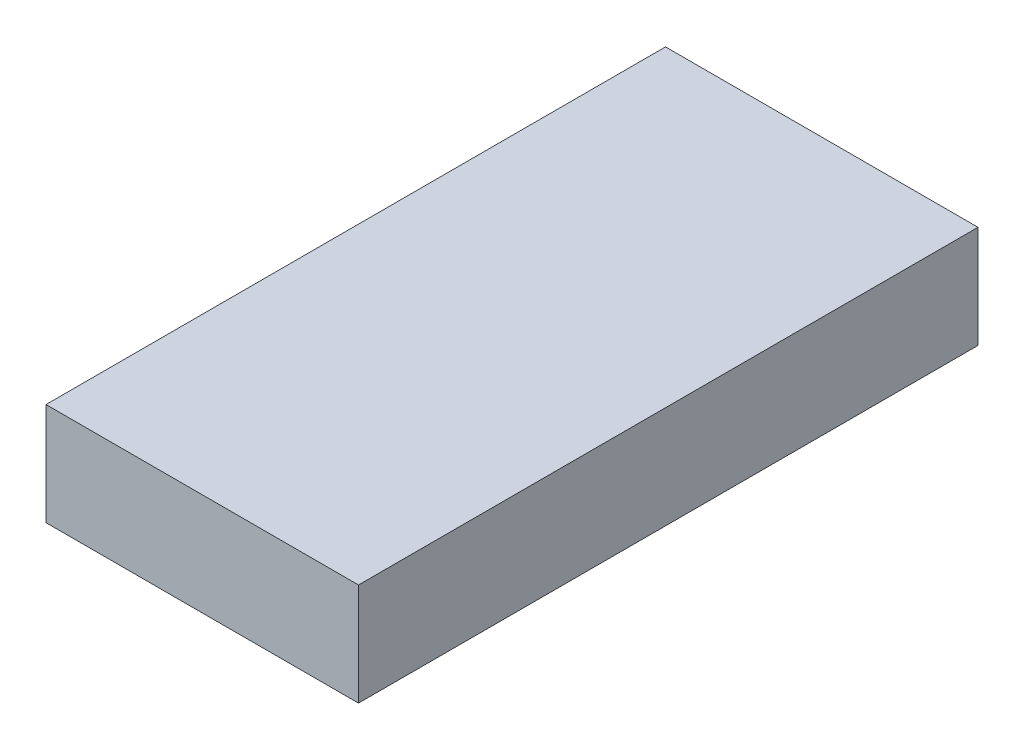
ISO-10303-21;
HEADER;
FILE_DESCRIPTION(('STEP AP214'),'2;1');
FILE_NAME('part.step','',(''),(''),'','','');
FILE_SCHEMA(('AUTOMOTIVE_DESIGN { 1 0 10303 214 1 1 1 1 }'));
ENDSEC;
DATA;
#1=APPLICATION_CONTEXT('core data for automotive mechanical design processes');
#2=APPLICATION_PROTOCOL_DEFINITION('international standard','automotive_design',2000,#1);
#3=PRODUCT_CONTEXT('',#1,'mechanical');
#4=PRODUCT('Part','Part','',(#3));
#5=PRODUCT_RELATED_PRODUCT_CATEGORY('part','',(#4));
#6=PRODUCT_DEFINITION_FORMATION('','',#4);
#7=PRODUCT_DEFINITION_CONTEXT('part definition',#1,'design');
#8=PRODUCT_DEFINITION('design','',#6,#7);
#9=PRODUCT_DEFINITION_SHAPE('','',#8);
#10=(LENGTH_UNIT() NAMED_UNIT(*) SI_UNIT(.MILLI.,.METRE.));
#11=(NAMED_UNIT(*) PLANE_ANGLE_UNIT() SI_UNIT($,.RADIAN.));
#12=(NAMED_UNIT(*) SI_UNIT($,.STERADIAN.) SOLID_ANGLE_UNIT());
#13=UNCERTAINTY_MEASURE_WITH_UNIT(LENGTH_MEASURE(1.E-05),#10,'distance_accuracy_value','');
#14=(GEOMETRIC_REPRESENTATION_CONTEXT(3) GLOBAL_UNCERTAINTY_ASSIGNED_CONTEXT((#13)) GLOBAL_UNIT_ASSIGNED_CONTEXT((#10,
#11,#12)) REPRESENTATION_CONTEXT('',''));
#15=CARTESIAN_POINT('',(0.,0.,0.));
#16=DIRECTION('',(0.,0.,1.));
#17=DIRECTION('',(1.,0.,0.));
#18=AXIS2_PLACEMENT_3D('',#15,#16,#17);
#19=CARTESIAN_POINT('',(17.1,11.2,33.9));
#20=DIRECTION('',(-1.,0.,0.));
#21=DIRECTION('',(0.,0.,1.));
#22=AXIS2_PLACEMENT_3D('',#19,#20,#21);
#23=PLANE('',#22);
#24=DIRECTION('',(0.,0.,-1.));
#25=VECTOR('',#24,1.);
#26=CARTESIAN_POINT('',(17.1,0.,33.9));
#27=LINE('',#26,#25);
#28=CARTESIAN_POINT('',(17.1,0.,33.9));
#29=VERTEX_POINT('',#28);
#30=CARTESIAN_POINT('',(17.1,0.,-33.9));
#31=VERTEX_POINT('',#30);
#32=EDGE_CURVE('E98',#29,#31,#27,.T.);
#33=ORIENTED_EDGE('',*,*,#32,.T.);
#34=DIRECTION('',(0.,-1.,0.));
#35=VECTOR('',#34,1.);
#36=CARTESIAN_POINT('',(17.1,11.2,-33.9));
#37=LINE('',#36,#35);
#38=CARTESIAN_POINT('',(17.1,11.2,-33.9));
#39=VERTEX_POINT('',#38);
#40=EDGE_CURVE('E11',#39,#31,#37,.T.);
#41=ORIENTED_EDGE('',*,*,#40,.F.);
#42=DIRECTION('',(0.,0.,-1.));
#43=VECTOR('',#42,1.);
#44=CARTESIAN_POINT('',(17.1,11.2,33.9));
#45=LINE('',#44,#43);
#46=CARTESIAN_POINT('',(17.1,11.2,33.9));
#47=VERTEX_POINT('',#46);
#48=EDGE_CURVE('E86',#47,#39,#45,.T.);
#49=ORIENTED_EDGE('',*,*,#48,.F.);
#50=DIRECTION('',(0.,-1.,0.));
#51=VECTOR('',#50,1.);
#52=CARTESIAN_POINT('',(17.1,11.2,33.9));
#53=LINE('',#52,#51);
#54=EDGE_CURVE('E94',#47,#29,#53,.T.);
#55=ORIENTED_EDGE('',*,*,#54,.T.);
#56=EDGE_LOOP('',(#33,#41,#49,#55));
#57=FACE_BOUND('',#56,.T.);
#58=ADVANCED_FACE('F35',(#57),#23,.F.);
#59=CARTESIAN_POINT('',(-17.1,11.2,-33.9));
#60=DIRECTION('',(0.,0.,1.));
#61=DIRECTION('',(1.,0.,0.));
#62=AXIS2_PLACEMENT_3D('',#59,#60,#61);
#63=PLANE('',#62);
#64=DIRECTION('',(-1.,0.,0.));
#65=VECTOR('',#64,1.);
#66=CARTESIAN_POINT('',(-17.1,0.,-33.9));
#67=LINE('',#66,#65);
#68=CARTESIAN_POINT('',(-17.1,0.,-33.9));
#69=VERTEX_POINT('',#68);
#70=EDGE_CURVE('E90',#31,#69,#67,.T.);
#71=ORIENTED_EDGE('',*,*,#70,.T.);
#72=DIRECTION('',(0.,-1.,0.));
#73=VECTOR('',#72,1.);
#74=CARTESIAN_POINT('',(-17.1,11.2,-33.9));
#75=LINE('',#74,#73);
#76=CARTESIAN_POINT('',(-17.1,11.2,-33.9));
#77=VERTEX_POINT('',#76);
#78=EDGE_CURVE('E43',#77,#69,#75,.T.);
#79=ORIENTED_EDGE('',*,*,#78,.F.);
#80=DIRECTION('',(-1.,0.,0.));
#81=VECTOR('',#80,1.);
#82=CARTESIAN_POINT('',(-17.1,11.2,-33.9));
#83=LINE('',#82,#81);
#84=EDGE_CURVE('E81',#39,#77,#83,.T.);
#85=ORIENTED_EDGE('',*,*,#84,.F.);
#86=ORIENTED_EDGE('',*,*,#40,.T.);
#87=EDGE_LOOP('',(#71,#79,#85,#86));
#88=FACE_BOUND('',#87,.T.);
#89=ADVANCED_FACE('F89',(#88),#63,.F.);
#90=CARTESIAN_POINT('',(-17.1,11.2,33.9));
#91=DIRECTION('',(1.,0.,0.));
#92=DIRECTION('',(0.,0.,-1.));
#93=AXIS2_PLACEMENT_3D('',#90,#91,#92);
#94=PLANE('',#93);
#95=DIRECTION('',(0.,0.,1.));
#96=VECTOR('',#95,1.);
#97=CARTESIAN_POINT('',(-17.1,0.,33.9));
#98=LINE('',#97,#96);
#99=CARTESIAN_POINT('',(-17.1,0.,33.9));
#100=VERTEX_POINT('',#99);
#101=EDGE_CURVE('E68',#69,#100,#98,.T.);
#102=ORIENTED_EDGE('',*,*,#101,.T.);
#103=DIRECTION('',(0.,-1.,0.));
#104=VECTOR('',#103,1.);
#105=CARTESIAN_POINT('',(-17.1,11.2,33.9));
#106=LINE('',#105,#104);
#107=CARTESIAN_POINT('',(-17.1,11.2,33.9));
#108=VERTEX_POINT('',#107);
#109=EDGE_CURVE('E91',#108,#100,#106,.T.);
#110=ORIENTED_EDGE('',*,*,#109,.F.);
#111=DIRECTION('',(0.,0.,1.));
#112=VECTOR('',#111,1.);
#113=CARTESIAN_POINT('',(-17.1,11.2,33.9));
#114=LINE('',#113,#112);
#115=EDGE_CURVE('E84',#77,#108,#114,.T.);
#116=ORIENTED_EDGE('',*,*,#115,.F.);
#117=ORIENTED_EDGE('',*,*,#78,.T.);
#118=EDGE_LOOP('',(#102,#110,#116,#117));
#119=FACE_BOUND('',#118,.T.);
#120=ADVANCED_FACE('F92',(#119),#94,.F.);
#121=CARTESIAN_POINT('',(-17.1,11.2,33.9));
#122=DIRECTION('',(0.,0.,-1.));
#123=DIRECTION('',(-1.,0.,0.));
#124=AXIS2_PLACEMENT_3D('',#121,#122,#123);
#125=PLANE('',#124);
#126=DIRECTION('',(1.,0.,0.));
#127=VECTOR('',#126,1.);
#128=CARTESIAN_POINT('',(-17.1,0.,33.9));
#129=LINE('',#128,#127);
#130=EDGE_CURVE('E74',#100,#29,#129,.T.);
#131=ORIENTED_EDGE('',*,*,#130,.T.);
#132=ORIENTED_EDGE('',*,*,#54,.F.);
#133=DIRECTION('',(1.,0.,0.));
#134=VECTOR('',#133,1.);
#135=CARTESIAN_POINT('',(-17.1,11.2,33.9));
#136=LINE('',#135,#134);
#137=EDGE_CURVE('E51',#108,#47,#136,.T.);
#138=ORIENTED_EDGE('',*,*,#137,.F.);
#139=ORIENTED_EDGE('',*,*,#109,.T.);
#140=EDGE_LOOP('',(#131,#132,#138,#139));
#141=FACE_BOUND('',#140,.T.);
#142=ADVANCED_FACE('F105',(#141),#125,.F.);
#143=CARTESIAN_POINT('',(0.,11.2,0.));
#144=DIRECTION('',(0.,-1.,0.));
#145=DIRECTION('',(0.,0.,-1.));
#146=AXIS2_PLACEMENT_3D('',#143,#144,#145);
#147=PLANE('',#146);
#148=ORIENTED_EDGE('',*,*,#48,.T.);
#149=ORIENTED_EDGE('',*,*,#84,.T.);
#150=ORIENTED_EDGE('',*,*,#115,.T.);
#151=ORIENTED_EDGE('',*,*,#137,.T.);
#152=EDGE_LOOP('',(#148,#149,#150,#151));
#153=FACE_BOUND('',#152,.T.);
#154=ADVANCED_FACE('F82',(#153),#147,.F.);
#155=CARTESIAN_POINT('',(0.,0.,0.));
#156=DIRECTION('',(0.,-1.,0.));
#157=DIRECTION('',(0.,0.,-1.));
#158=AXIS2_PLACEMENT_3D('',#155,#156,#157);
#159=PLANE('',#158);
#160=ORIENTED_EDGE('',*,*,#32,.F.);
#161=ORIENTED_EDGE('',*,*,#130,.F.);
#162=ORIENTED_EDGE('',*,*,#101,.F.);
#163=ORIENTED_EDGE('',*,*,#70,.F.);
#164=EDGE_LOOP('',(#160,#161,#162,#163));
#165=FACE_BOUND('',#164,.T.);
#166=ADVANCED_FACE('F108',(#165),#159,.T.);
#167=CLOSED_SHELL('',(#58,#89,#120,#142,#154,#166));
#168=MANIFOLD_SOLID_BREP('B2',#167);
#169=ADVANCED_BREP_SHAPE_REPRESENTATION('',(#18,#168),#14);
#170=SHAPE_DEFINITION_REPRESENTATION(#9,#169);
ENDSEC;
END-ISO-10303-21;
